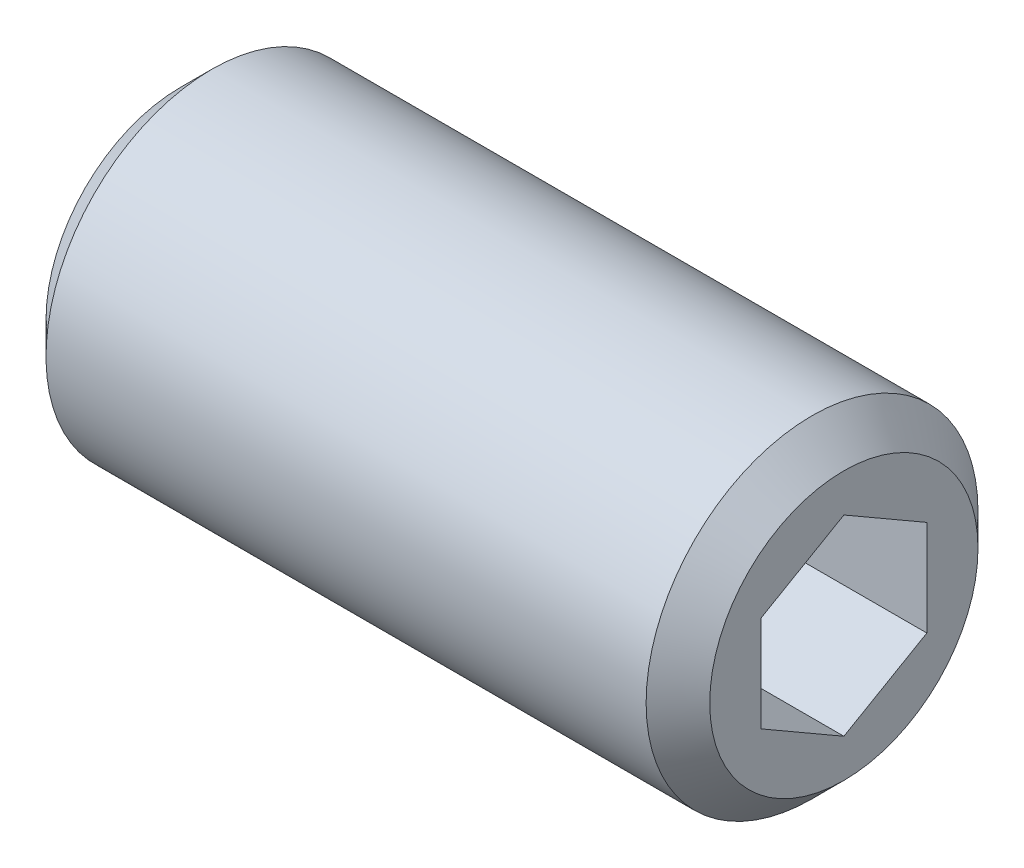
ISO-10303-21;
HEADER;
FILE_DESCRIPTION(('STEP AP214'),'2;1');
FILE_NAME('part.step','',(''),(''),'','','');
FILE_SCHEMA(('AUTOMOTIVE_DESIGN { 1 0 10303 214 1 1 1 1 }'));
ENDSEC;
DATA;
#1=APPLICATION_CONTEXT('core data for automotive mechanical design processes');
#2=APPLICATION_PROTOCOL_DEFINITION('international standard','automotive_design',2000,#1);
#3=PRODUCT_CONTEXT('',#1,'mechanical');
#4=PRODUCT('Part','Part','',(#3));
#5=PRODUCT_RELATED_PRODUCT_CATEGORY('part','',(#4));
#6=PRODUCT_DEFINITION_FORMATION('','',#4);
#7=PRODUCT_DEFINITION_CONTEXT('part definition',#1,'design');
#8=PRODUCT_DEFINITION('design','',#6,#7);
#9=PRODUCT_DEFINITION_SHAPE('','',#8);
#10=(LENGTH_UNIT() NAMED_UNIT(*) SI_UNIT(.MILLI.,.METRE.));
#11=(NAMED_UNIT(*) PLANE_ANGLE_UNIT() SI_UNIT($,.RADIAN.));
#12=(NAMED_UNIT(*) SI_UNIT($,.STERADIAN.) SOLID_ANGLE_UNIT());
#13=UNCERTAINTY_MEASURE_WITH_UNIT(LENGTH_MEASURE(1.E-05),#10,'distance_accuracy_value','');
#14=(GEOMETRIC_REPRESENTATION_CONTEXT(3) GLOBAL_UNCERTAINTY_ASSIGNED_CONTEXT((#13)) GLOBAL_UNIT_ASSIGNED_CONTEXT((#10,
#11,#12)) REPRESENTATION_CONTEXT('',''));
#15=CARTESIAN_POINT('',(0.,0.,0.));
#16=DIRECTION('',(0.,0.,1.));
#17=DIRECTION('',(1.,0.,0.));
#18=AXIS2_PLACEMENT_3D('',#15,#16,#17);
#19=CARTESIAN_POINT('',(11.0080000013113,0.,0.));
#20=DIRECTION('',(1.,0.,0.));
#21=DIRECTION('',(0.,0.,-1.));
#22=AXIS2_PLACEMENT_3D('',#19,#20,#21);
#23=CONICAL_SURFACE('',#22,2.32325748214634,1.04719754985041);
#24=CARTESIAN_POINT('',(9.66666666477067,-1.70530256582424E-10,0.));
#25=VERTEX_POINT('',#24);
#26=VERTEX_LOOP('',#25);
#27=FACE_BOUND('',#26,.T.);
#28=CARTESIAN_POINT('',(11.0000000015463,-1.15470053890749,1.99999999978952));
#29=CARTESIAN_POINT('',(10.970695546729,-1.20544263427257,1.91211211208328));
#30=CARTESIAN_POINT('',(10.9440446786853,-1.25662273479194,1.82346557746206));
#31=CARTESIAN_POINT('',(10.8975263889011,-1.35986908513588,1.64463765283451));
#32=CARTESIAN_POINT('',(10.877675421772,-1.41193716885137,1.55445308643649));
#33=CARTESIAN_POINT('',(10.8467759602991,-1.5154280825947,1.37520156574686));
#34=CARTESIAN_POINT('',(10.8355217889338,-1.56683499367993,1.28616218387419));
#35=CARTESIAN_POINT('',(10.822089169462,-1.66989057616154,1.10766467900308));
#36=CARTESIAN_POINT('',(10.8198995953163,-1.72153887323591,1.01820720434936));
#37=CARTESIAN_POINT('',(10.8244662915442,-1.81803817557173,0.851065509810939));
#38=CARTESIAN_POINT('',(10.8301012866309,-1.8629036613402,0.773356208952951));
#39=CARTESIAN_POINT('',(10.8479573021892,-1.95234234887103,0.618443857986715));
#40=CARTESIAN_POINT('',(10.8601844162709,-1.99691524151975,0.541241343279018));
#41=CARTESIAN_POINT('',(10.8907498349095,-2.08653818118143,0.386009858261453));
#42=CARTESIAN_POINT('',(10.9092176438278,-2.13157689092394,0.308000524680035));
#43=CARTESIAN_POINT('',(10.9511317625293,-2.22098275233646,0.153145030219006));
#44=CARTESIAN_POINT('',(10.9745682304842,-2.26535104851535,0.0762968869918664));
#45=CARTESIAN_POINT('',(11.0000000017753,-2.30940107653259,3.91234845948038E-10));
#46=B_SPLINE_CURVE_WITH_KNOTS('',3,(#28,#29,#30,#31,#32,#33,#34,#35,#36,#37,#38,#39,#40,#41,#42,
#43,#44,#45),.UNSPECIFIED.,.F.,.F.,(4,2,2,2,2,2,2,2,4),(0.,0.317016011624381,0.634793817174247,
0.944707606342016,1.25424088912324,1.52370778259738,1.79342419350259,2.06912162195613,
2.34427797273706),.UNSPECIFIED.);
#47=CARTESIAN_POINT('',(11.0000000017592,-1.15470053825233,1.99999999978011));
#48=VERTEX_POINT('',#47);
#49=CARTESIAN_POINT('',(11.0000000018325,-2.30940107663154,2.19849960238795E-10));
#50=VERTEX_POINT('',#49);
#51=EDGE_CURVE('E20',#48,#50,#46,.T.);
#52=ORIENTED_EDGE('',*,*,#51,.T.);
#53=CARTESIAN_POINT('',(11.0000000015463,-2.30940107684033,-5.62723461490458E-10));
#54=CARTESIAN_POINT('',(10.970695546729,-2.25865898108431,-0.0878878880432485));
#55=CARTESIAN_POINT('',(10.9440446786853,-2.20747888040456,-0.176534422571881));
#56=CARTESIAN_POINT('',(10.8975263889011,-2.10423252994303,-0.355362347131533));
#57=CARTESIAN_POINT('',(10.877675421772,-2.05216444627081,-0.44554691355454));
#58=CARTESIAN_POINT('',(10.8467759602991,-1.94867353255825,-0.624798434261942));
#59=CARTESIAN_POINT('',(10.8355217889338,-1.89726662146188,-0.713837816128169));
#60=CARTESIAN_POINT('',(10.822089169462,-1.79421103897216,-0.892335320994605));
#61=CARTESIAN_POINT('',(10.8198995953163,-1.74256274190082,-0.981792795650074));
#62=CARTESIAN_POINT('',(10.8244662915442,-1.64606343956689,-1.14893449018958));
#63=CARTESIAN_POINT('',(10.8301012866309,-1.60119795379777,-1.2266437910472));
#64=CARTESIAN_POINT('',(10.8479573021892,-1.51175926626646,-1.38155614201315));
#65=CARTESIAN_POINT('',(10.8601844162709,-1.46718637361791,-1.45875865672094));
#66=CARTESIAN_POINT('',(10.8907498349095,-1.37756343395636,-1.61399014173858));
#67=CARTESIAN_POINT('',(10.9092176438278,-1.33252472421382,-1.69199947531997));
#68=CARTESIAN_POINT('',(10.9511317625293,-1.24311886280122,-1.84685496978096));
#69=CARTESIAN_POINT('',(10.9745682304842,-1.1987505666223,-1.92370311300807));
#70=CARTESIAN_POINT('',(11.0000000017753,-1.15470053860512,-1.99999999960874));
#71=B_SPLINE_CURVE_WITH_KNOTS('',3,(#53,#54,#55,#56,#57,#58,#59,#60,#61,#62,#63,#64,#65,#66,#67,
#68,#69,#70),.UNSPECIFIED.,.F.,.F.,(4,2,2,2,2,2,2,2,4),(0.,0.317016011624382,0.634793817174249,
0.944707606342019,1.25424088912325,1.52370778259737,1.79342419350258,2.06912162195611,
2.34427797273704),.UNSPECIFIED.);
#72=CARTESIAN_POINT('',(11.0000000018325,-1.15470053850617,-1.99999999978013));
#73=VERTEX_POINT('',#72);
#74=EDGE_CURVE('E111',#50,#73,#71,.T.);
#75=ORIENTED_EDGE('',*,*,#74,.T.);
#76=CARTESIAN_POINT('',(11.0000000015463,-1.15470053793283,-2.00000000035222));
#77=CARTESIAN_POINT('',(10.970695546729,-1.05321634681174,-2.00000000012652));
#78=CARTESIAN_POINT('',(10.9440446786853,-0.950856145612615,-2.00000000003393));
#79=CARTESIAN_POINT('',(10.8975263889011,-0.744363444807143,-1.99999999996604));
#80=CARTESIAN_POINT('',(10.877675421772,-0.640227277419423,-1.99999999999103));
#81=CARTESIAN_POINT('',(10.8467759602991,-0.433245449963544,-2.0000000000088));
#82=CARTESIAN_POINT('',(10.8355217889338,-0.330431627781939,-2.00000000000236));
#83=CARTESIAN_POINT('',(10.822089169462,-0.12432046281061,-1.99999999999769));
#84=CARTESIAN_POINT('',(10.8198995953163,-0.0210238686649022,-1.99999999999944));
#85=CARTESIAN_POINT('',(10.8244662915442,0.17197473600486,-2.00000000000053));
#86=CARTESIAN_POINT('',(10.830101286631,0.261705707542435,-2.00000000000016));
#87=CARTESIAN_POINT('',(10.8479573021892,0.440583082604577,-1.99999999999989));
#88=CARTESIAN_POINT('',(10.860184416271,0.529728867901839,-1.99999999999998));
#89=CARTESIAN_POINT('',(10.8907498349096,0.708974747225071,-2.00000000000006));
#90=CARTESIAN_POINT('',(10.9092176438279,0.799052166710125,-2.00000000000004));
#91=CARTESIAN_POINT('',(10.9511317625294,0.977863889535231,-2.));
#92=CARTESIAN_POINT('',(10.9745682304842,1.06660048189304,-1.99999999999998));
#93=CARTESIAN_POINT('',(11.0000000017754,1.15470053792747,-2.00000000000002));
#94=B_SPLINE_CURVE_WITH_KNOTS('',3,(#76,#77,#78,#79,#80,#81,#82,#83,#84,#85,#86,#87,#88,#89,#90,
#91,#92,#93),.UNSPECIFIED.,.F.,.F.,(4,2,2,2,2,2,2,2,4),(0.,0.317016011624382,0.63479381717425,
0.944707606342019,1.25424088912325,1.52370778259737,1.79342419350258,2.06912162195611,
2.34427797273703),.UNSPECIFIED.);
#95=CARTESIAN_POINT('',(11.0000000018325,1.15470053812537,-2.));
#96=VERTEX_POINT('',#95);
#97=EDGE_CURVE('E107',#73,#96,#94,.T.);
#98=ORIENTED_EDGE('',*,*,#97,.T.);
#99=CARTESIAN_POINT('',(11.0000000015463,1.15470053890749,-1.99999999978952));
#100=CARTESIAN_POINT('',(10.970695546729,1.20544263427257,-1.91211211208328));
#101=CARTESIAN_POINT('',(10.9440446786854,1.25662273479194,-1.82346557746205));
#102=CARTESIAN_POINT('',(10.8975263889011,1.35986908513588,-1.64463765283451));
#103=CARTESIAN_POINT('',(10.877675421772,1.41193716885138,-1.55445308643649));
#104=CARTESIAN_POINT('',(10.8467759602991,1.5154280825947,-1.37520156574686));
#105=CARTESIAN_POINT('',(10.8355217889338,1.56683499367993,-1.28616218387419));
#106=CARTESIAN_POINT('',(10.822089169462,1.66989057616154,-1.10766467900308));
#107=CARTESIAN_POINT('',(10.8198995953163,1.72153887323591,-1.01820720434936));
#108=CARTESIAN_POINT('',(10.8244662915442,1.81803817557174,-0.851065509810937));
#109=CARTESIAN_POINT('',(10.8301012866309,1.8629036613402,-0.773356208952951));
#110=CARTESIAN_POINT('',(10.8479573021892,1.95234234887103,-0.618443857986719));
#111=CARTESIAN_POINT('',(10.8601844162709,1.99691524151975,-0.541241343279024));
#112=CARTESIAN_POINT('',(10.8907498349095,2.08653818118143,-0.386009858261463));
#113=CARTESIAN_POINT('',(10.9092176438278,2.13157689092394,-0.308000524680047));
#114=CARTESIAN_POINT('',(10.9511317625293,2.22098275233645,-0.153145030219021));
#115=CARTESIAN_POINT('',(10.9745682304842,2.26535104851534,-0.0762968869918836));
#116=CARTESIAN_POINT('',(11.0000000017753,2.30940107653259,-3.91254547009403E-10));
#117=B_SPLINE_CURVE_WITH_KNOTS('',3,(#99,#100,#101,#102,#103,#104,#105,#106,#107,#108,#109,#110,
#111,#112,#113,#114,#115,#116),.UNSPECIFIED.,.F.,.F.,(4,2,2,2,2,2,2,2,4),(0.,0.317016011624383,
0.63479381717425,0.94470760634202,1.25424088912325,1.52370778259737,1.79342419350258,
2.06912162195611,2.34427797273704),.UNSPECIFIED.);
#118=CARTESIAN_POINT('',(11.0000000018325,2.30940107663155,-2.19877675805291E-10));
#119=VERTEX_POINT('',#118);
#120=EDGE_CURVE('E103',#96,#119,#117,.T.);
#121=ORIENTED_EDGE('',*,*,#120,.T.);
#122=CARTESIAN_POINT('',(11.0000000015463,2.30940107684033,5.62698290783199E-10));
#123=CARTESIAN_POINT('',(10.9706955467291,2.25865898108432,0.0878878880432257));
#124=CARTESIAN_POINT('',(10.9440446786854,2.20747888040457,0.17653442257186));
#125=CARTESIAN_POINT('',(10.8975263889011,2.10423252994304,0.355362347131512));
#126=CARTESIAN_POINT('',(10.877675421772,2.05216444627082,0.44554691355452));
#127=CARTESIAN_POINT('',(10.8467759602991,1.94867353255826,0.624798434261922));
#128=CARTESIAN_POINT('',(10.8355217889338,1.89726662146189,0.71383781612815));
#129=CARTESIAN_POINT('',(10.822089169462,1.79421103897217,0.892335320994587));
#130=CARTESIAN_POINT('',(10.8198995953163,1.74256274190083,0.981792795650056));
#131=CARTESIAN_POINT('',(10.8244662915442,1.64606343956689,1.14893449018957));
#132=CARTESIAN_POINT('',(10.8301012866309,1.60119795379778,1.22664379104718));
#133=CARTESIAN_POINT('',(10.8479573021892,1.51175926626646,1.38155614201314));
#134=CARTESIAN_POINT('',(10.8601844162709,1.46718637361791,1.45875865672093));
#135=CARTESIAN_POINT('',(10.8907498349095,1.37756343395636,1.61399014173857));
#136=CARTESIAN_POINT('',(10.9092176438278,1.33252472421381,1.69199947531997));
#137=CARTESIAN_POINT('',(10.9511317625293,1.24311886280122,1.84685496978096));
#138=CARTESIAN_POINT('',(10.9745682304842,1.19875056662229,1.92370311300807));
#139=CARTESIAN_POINT('',(11.0000000017753,1.15470053860511,1.99999999960874));
#140=B_SPLINE_CURVE_WITH_KNOTS('',3,(#122,#123,#124,#125,#126,#127,#128,#129,#130,#131,#132,
#133,#134,#135,#136,#137,#138,#139),.UNSPECIFIED.,.F.,.F.,(4,2,2,2,2,2,2,2,4),(0.,
0.317016011624385,0.634793817174255,0.944707606342027,1.25424088912326,1.52370778259739,
1.7934241935026,2.06912162195614,2.34427797273707),.UNSPECIFIED.);
#141=CARTESIAN_POINT('',(11.0000000018325,1.15470053850616,1.99999999978013));
#142=VERTEX_POINT('',#141);
#143=EDGE_CURVE('E86',#119,#142,#140,.T.);
#144=ORIENTED_EDGE('',*,*,#143,.T.);
#145=CARTESIAN_POINT('',(11.0000000015463,1.15470053793282,2.00000000035222));
#146=CARTESIAN_POINT('',(10.970695546729,1.05321634681174,2.00000000012652));
#147=CARTESIAN_POINT('',(10.9440446786853,0.950856145612608,2.00000000003393));
#148=CARTESIAN_POINT('',(10.8975263889011,0.744363444807138,1.99999999996604));
#149=CARTESIAN_POINT('',(10.877675421772,0.640227277419417,1.99999999999103));
#150=CARTESIAN_POINT('',(10.8467759602991,0.433245449963538,2.0000000000088));
#151=CARTESIAN_POINT('',(10.8355217889338,0.330431627781933,2.00000000000236));
#152=CARTESIAN_POINT('',(10.822089169462,0.124320462810605,1.99999999999769));
#153=CARTESIAN_POINT('',(10.8198995953163,0.0210238686648968,1.99999999999944));
#154=CARTESIAN_POINT('',(10.8244662915442,-0.171974736004865,2.00000000000053));
#155=CARTESIAN_POINT('',(10.830101286631,-0.261705707542441,2.00000000000016));
#156=CARTESIAN_POINT('',(10.8479573021892,-0.440583082604583,1.99999999999989));
#157=CARTESIAN_POINT('',(10.860184416271,-0.529728867901845,1.99999999999998));
#158=CARTESIAN_POINT('',(10.8907498349096,-0.708974747225078,2.00000000000006));
#159=CARTESIAN_POINT('',(10.9092176438279,-0.799052166710132,2.00000000000004));
#160=CARTESIAN_POINT('',(10.9511317625294,-0.977863889535238,2.));
#161=CARTESIAN_POINT('',(10.9745682304842,-1.06660048189305,1.99999999999998));
#162=CARTESIAN_POINT('',(11.0000000017754,-1.15470053792748,2.00000000000002));
#163=B_SPLINE_CURVE_WITH_KNOTS('',3,(#145,#146,#147,#148,#149,#150,#151,#152,#153,#154,#155,
#156,#157,#158,#159,#160,#161,#162),.UNSPECIFIED.,.F.,.F.,(4,2,2,2,2,2,2,2,4),(0.,
0.317016011624382,0.634793817174248,0.944707606342018,1.25424088912325,1.52370778259737,
1.79342419350258,2.06912162195611,2.34427797273703),.UNSPECIFIED.);
#164=EDGE_CURVE('E84',#142,#48,#163,.T.);
#165=ORIENTED_EDGE('',*,*,#164,.T.);
#166=EDGE_LOOP('',(#52,#75,#98,#121,#144,#165));
#167=FACE_BOUND('',#166,.T.);
#168=ADVANCED_FACE('F16',(#27,#167),#23,.F.);
#169=CARTESIAN_POINT('',(16.,-1.15470053837929,1.99999999999997));
#170=DIRECTION('',(0.,-0.866025403784449,0.499999999999983));
#171=DIRECTION('',(0.,-0.499999999999983,-0.866025403784449));
#172=AXIS2_PLACEMENT_3D('',#169,#170,#171);
#173=PLANE('',#172);
#174=DIRECTION('',(1.,0.,0.));
#175=VECTOR('',#174,1.);
#176=CARTESIAN_POINT('',(16.,-1.15470053837929,2.00000000000002));
#177=LINE('',#176,#175);
#178=CARTESIAN_POINT('',(16.,-1.15470053837929,2.00000000000002));
#179=VERTEX_POINT('',#178);
#180=EDGE_CURVE('E77',#48,#179,#177,.T.);
#181=ORIENTED_EDGE('',*,*,#180,.T.);
#182=DIRECTION('',(0.,-0.499999999999983,-0.866025403784449));
#183=VECTOR('',#182,1.);
#184=CARTESIAN_POINT('',(16.,-1.15470053837929,1.99999999999997));
#185=LINE('',#184,#183);
#186=CARTESIAN_POINT('',(16.,-2.3094010767585,0.));
#187=VERTEX_POINT('',#186);
#188=EDGE_CURVE('E88',#179,#187,#185,.T.);
#189=ORIENTED_EDGE('',*,*,#188,.T.);
#190=DIRECTION('',(1.,0.,0.));
#191=VECTOR('',#190,1.);
#192=CARTESIAN_POINT('',(16.,-2.3094010767585,0.));
#193=LINE('',#192,#191);
#194=EDGE_CURVE('E80',#187,#50,#193,.F.);
#195=ORIENTED_EDGE('',*,*,#194,.T.);
#196=ORIENTED_EDGE('',*,*,#51,.F.);
#197=EDGE_LOOP('',(#181,#189,#195,#196));
#198=FACE_BOUND('',#197,.T.);
#199=ADVANCED_FACE('F75',(#198),#173,.F.);
#200=CARTESIAN_POINT('',(16.,-2.3094010767585,0.));
#201=DIRECTION('',(0.,-0.866025403784429,-0.500000000000017));
#202=DIRECTION('',(0.,0.500000000000017,-0.866025403784429));
#203=AXIS2_PLACEMENT_3D('',#200,#201,#202);
#204=PLANE('',#203);
#205=ORIENTED_EDGE('',*,*,#194,.F.);
#206=DIRECTION('',(0.,0.500000000000017,-0.866025403784429));
#207=VECTOR('',#206,1.);
#208=CARTESIAN_POINT('',(16.,-2.3094010767585,0.));
#209=LINE('',#208,#207);
#210=CARTESIAN_POINT('',(16.,-1.15470053837921,-2.00000000000002));
#211=VERTEX_POINT('',#210);
#212=EDGE_CURVE('E118',#187,#211,#209,.T.);
#213=ORIENTED_EDGE('',*,*,#212,.T.);
#214=DIRECTION('',(-1.,0.,0.));
#215=VECTOR('',#214,1.);
#216=CARTESIAN_POINT('',(16.,-1.15470053837921,-2.00000000000002));
#217=LINE('',#216,#215);
#218=EDGE_CURVE('E108',#211,#73,#217,.T.);
#219=ORIENTED_EDGE('',*,*,#218,.T.);
#220=ORIENTED_EDGE('',*,*,#74,.F.);
#221=EDGE_LOOP('',(#205,#213,#219,#220));
#222=FACE_BOUND('',#221,.T.);
#223=ADVANCED_FACE('F168',(#222),#204,.F.);
#224=CARTESIAN_POINT('',(16.,-1.15470053837921,-2.00000000000002));
#225=DIRECTION('',(0.,0.,-1.));
#226=DIRECTION('',(-1.,0.,0.));
#227=AXIS2_PLACEMENT_3D('',#224,#225,#226);
#228=PLANE('',#227);
#229=ORIENTED_EDGE('',*,*,#218,.F.);
#230=DIRECTION('',(0.,1.,0.));
#231=VECTOR('',#230,1.);
#232=CARTESIAN_POINT('',(16.,0.,-2.00000000000002));
#233=LINE('',#232,#231);
#234=CARTESIAN_POINT('',(16.,1.15470053837928,-1.99999999999999));
#235=VERTEX_POINT('',#234);
#236=EDGE_CURVE('E120',#211,#235,#233,.T.);
#237=ORIENTED_EDGE('',*,*,#236,.T.);
#238=DIRECTION('',(1.,0.,0.));
#239=VECTOR('',#238,1.);
#240=CARTESIAN_POINT('',(16.,1.15470053837929,-1.99999999999998));
#241=LINE('',#240,#239);
#242=EDGE_CURVE('E104',#235,#96,#241,.F.);
#243=ORIENTED_EDGE('',*,*,#242,.T.);
#244=ORIENTED_EDGE('',*,*,#97,.F.);
#245=EDGE_LOOP('',(#229,#237,#243,#244));
#246=FACE_BOUND('',#245,.T.);
#247=ADVANCED_FACE('F151',(#246),#228,.F.);
#248=CARTESIAN_POINT('',(16.,1.15470053837929,-1.99999999999998));
#249=DIRECTION('',(0.,0.866025403784449,-0.499999999999983));
#250=DIRECTION('',(0.,0.499999999999983,0.866025403784449));
#251=AXIS2_PLACEMENT_3D('',#248,#249,#250);
#252=PLANE('',#251);
#253=ORIENTED_EDGE('',*,*,#242,.F.);
#254=DIRECTION('',(0.,0.49999999999999,0.866025403784445));
#255=VECTOR('',#254,1.);
#256=CARTESIAN_POINT('',(16.,1.15470053837929,-1.99999999999998));
#257=LINE('',#256,#255);
#258=CARTESIAN_POINT('',(16.,2.30940107675851,0.));
#259=VERTEX_POINT('',#258);
#260=EDGE_CURVE('E114',#235,#259,#257,.T.);
#261=ORIENTED_EDGE('',*,*,#260,.T.);
#262=DIRECTION('',(1.,0.,0.));
#263=VECTOR('',#262,1.);
#264=CARTESIAN_POINT('',(16.,2.30940107675852,0.));
#265=LINE('',#264,#263);
#266=EDGE_CURVE('E97',#259,#119,#265,.F.);
#267=ORIENTED_EDGE('',*,*,#266,.T.);
#268=ORIENTED_EDGE('',*,*,#120,.F.);
#269=EDGE_LOOP('',(#253,#261,#267,#268));
#270=FACE_BOUND('',#269,.T.);
#271=ADVANCED_FACE('F147',(#270),#252,.F.);
#272=CARTESIAN_POINT('',(16.,2.3094010767585,0.));
#273=DIRECTION('',(0.,0.866025403784428,0.500000000000019));
#274=DIRECTION('',(0.,-0.500000000000019,0.866025403784428));
#275=AXIS2_PLACEMENT_3D('',#272,#273,#274);
#276=PLANE('',#275);
#277=ORIENTED_EDGE('',*,*,#266,.F.);
#278=DIRECTION('',(0.,-0.500000000000009,0.866025403784433));
#279=VECTOR('',#278,1.);
#280=CARTESIAN_POINT('',(16.,2.3094010767585,0.));
#281=LINE('',#280,#279);
#282=CARTESIAN_POINT('',(16.,1.15470053837921,2.00000000000002));
#283=VERTEX_POINT('',#282);
#284=EDGE_CURVE('E39',#259,#283,#281,.T.);
#285=ORIENTED_EDGE('',*,*,#284,.T.);
#286=DIRECTION('',(1.,0.,0.));
#287=VECTOR('',#286,1.);
#288=CARTESIAN_POINT('',(16.,1.15470053837921,2.00000000000002));
#289=LINE('',#288,#287);
#290=EDGE_CURVE('E89',#283,#142,#289,.F.);
#291=ORIENTED_EDGE('',*,*,#290,.T.);
#292=ORIENTED_EDGE('',*,*,#143,.F.);
#293=EDGE_LOOP('',(#277,#285,#291,#292));
#294=FACE_BOUND('',#293,.T.);
#295=ADVANCED_FACE('F142',(#294),#276,.F.);
#296=CARTESIAN_POINT('',(16.,1.15470053837921,2.00000000000002));
#297=DIRECTION('',(0.,0.,1.));
#298=DIRECTION('',(1.,0.,0.));
#299=AXIS2_PLACEMENT_3D('',#296,#297,#298);
#300=PLANE('',#299);
#301=ORIENTED_EDGE('',*,*,#290,.F.);
#302=DIRECTION('',(0.,1.,0.));
#303=VECTOR('',#302,1.);
#304=CARTESIAN_POINT('',(16.,0.,2.00000000000002));
#305=LINE('',#304,#303);
#306=EDGE_CURVE('E93',#283,#179,#305,.F.);
#307=ORIENTED_EDGE('',*,*,#306,.T.);
#308=ORIENTED_EDGE('',*,*,#180,.F.);
#309=ORIENTED_EDGE('',*,*,#164,.F.);
#310=EDGE_LOOP('',(#301,#307,#308,#309));
#311=FACE_BOUND('',#310,.T.);
#312=ADVANCED_FACE('F91',(#311),#300,.F.);
#313=CARTESIAN_POINT('',(16.,0.,0.));
#314=DIRECTION('',(-1.,0.,0.));
#315=DIRECTION('',(0.,0.,1.));
#316=AXIS2_PLACEMENT_3D('',#313,#314,#315);
#317=PLANE('',#316);
#318=ORIENTED_EDGE('',*,*,#284,.F.);
#319=ORIENTED_EDGE('',*,*,#260,.F.);
#320=ORIENTED_EDGE('',*,*,#236,.F.);
#321=ORIENTED_EDGE('',*,*,#212,.F.);
#322=ORIENTED_EDGE('',*,*,#188,.F.);
#323=ORIENTED_EDGE('',*,*,#306,.F.);
#324=EDGE_LOOP('',(#318,#319,#320,#321,#322,#323));
#325=FACE_BOUND('',#324,.T.);
#326=CARTESIAN_POINT('',(16.0000000003038,0.,0.));
#327=DIRECTION('',(-1.,0.,0.));
#328=DIRECTION('',(0.,0.,1.));
#329=AXIS2_PLACEMENT_3D('',#326,#327,#328);
#330=CIRCLE('',#329,3.23318750037061);
#331=CARTESIAN_POINT('',(16.0000000003038,0.,3.23318750037061));
#332=VERTEX_POINT('',#331);
#333=EDGE_CURVE('E116',#332,#332,#330,.T.);
#334=ORIENTED_EDGE('',*,*,#333,.F.);
#335=EDGE_LOOP('',(#334));
#336=FACE_BOUND('',#335,.T.);
#337=ADVANCED_FACE('F141',(#325,#336),#317,.F.);
#338=CARTESIAN_POINT('',(0.,2.,0.));
#339=DIRECTION('',(-1.,0.,0.));
#340=DIRECTION('',(0.,0.,1.));
#341=AXIS2_PLACEMENT_3D('',#338,#339,#340);
#342=PLANE('',#341);
#343=CARTESIAN_POINT('',(-2.84217311144475E-10,0.,0.));
#344=DIRECTION('',(1.,0.,0.));
#345=DIRECTION('',(0.,1.,0.));
#346=AXIS2_PLACEMENT_3D('',#343,#344,#345);
#347=CIRCLE('',#346,3.23318750031376);
#348=CARTESIAN_POINT('',(-2.84217530233782E-10,3.23318750031376,0.));
#349=VERTEX_POINT('',#348);
#350=EDGE_CURVE('E123',#349,#349,#347,.T.);
#351=ORIENTED_EDGE('',*,*,#350,.F.);
#352=EDGE_LOOP('',(#351));
#353=FACE_BOUND('',#352,.T.);
#354=ADVANCED_FACE('F193',(#353),#342,.T.);
#355=CARTESIAN_POINT('',(15.2331874997458,0.,0.));
#356=DIRECTION('',(-1.,0.,0.));
#357=DIRECTION('',(0.,0.,1.));
#358=AXIS2_PLACEMENT_3D('',#355,#356,#357);
#359=CONICAL_SURFACE('',#358,3.99999999950751,0.78539816247083);
#360=ORIENTED_EDGE('',*,*,#333,.T.);
#361=EDGE_LOOP('',(#360));
#362=FACE_BOUND('',#361,.T.);
#363=CARTESIAN_POINT('',(15.2331875,0.,0.));
#364=DIRECTION('',(1.,0.,0.));
#365=DIRECTION('',(0.,1.,0.));
#366=AXIS2_PLACEMENT_3D('',#363,#364,#365);
#367=CIRCLE('',#366,4.);
#368=CARTESIAN_POINT('',(15.2331875,4.,0.));
#369=VERTEX_POINT('',#368);
#370=EDGE_CURVE('E30',#369,#369,#367,.F.);
#371=ORIENTED_EDGE('',*,*,#370,.F.);
#372=EDGE_LOOP('',(#371));
#373=FACE_BOUND('',#372,.T.);
#374=ADVANCED_FACE('F187',(#362,#373),#359,.T.);
#375=CARTESIAN_POINT('',(0.766812500330616,0.,0.));
#376=DIRECTION('',(1.,0.,0.));
#377=DIRECTION('',(0.,1.,0.));
#378=AXIS2_PLACEMENT_3D('',#375,#376,#377);
#379=CONICAL_SURFACE('',#378,3.9999999996212,0.785398162544959);
#380=CARTESIAN_POINT('',(0.7668125,0.,0.));
#381=DIRECTION('',(1.,0.,0.));
#382=DIRECTION('',(0.,1.,0.));
#383=AXIS2_PLACEMENT_3D('',#380,#381,#382);
#384=CIRCLE('',#383,4.);
#385=CARTESIAN_POINT('',(0.7668125,4.,0.));
#386=VERTEX_POINT('',#385);
#387=EDGE_CURVE('E11',#386,#386,#384,.T.);
#388=ORIENTED_EDGE('',*,*,#387,.F.);
#389=EDGE_LOOP('',(#388));
#390=FACE_BOUND('',#389,.T.);
#391=ORIENTED_EDGE('',*,*,#350,.T.);
#392=EDGE_LOOP('',(#391));
#393=FACE_BOUND('',#392,.T.);
#394=ADVANCED_FACE('F181',(#390,#393),#379,.T.);
#395=CARTESIAN_POINT('',(8.,0.,0.));
#396=DIRECTION('',(1.,0.,0.));
#397=DIRECTION('',(0.,1.,0.));
#398=AXIS2_PLACEMENT_3D('',#395,#396,#397);
#399=CYLINDRICAL_SURFACE('',#398,4.);
#400=ORIENTED_EDGE('',*,*,#387,.T.);
#401=EDGE_LOOP('',(#400));
#402=FACE_BOUND('',#401,.T.);
#403=ORIENTED_EDGE('',*,*,#370,.T.);
#404=EDGE_LOOP('',(#403));
#405=FACE_BOUND('',#404,.T.);
#406=ADVANCED_FACE('F179',(#402,#405),#399,.T.);
#407=CLOSED_SHELL('',(#168,#199,#223,#247,#271,#295,#312,#337,#354,#374,#394,#406));
#408=MANIFOLD_SOLID_BREP('B1',#407);
#409=ADVANCED_BREP_SHAPE_REPRESENTATION('',(#18,#408),#14);
#410=SHAPE_DEFINITION_REPRESENTATION(#9,#409);
ENDSEC;
END-ISO-10303-21;
